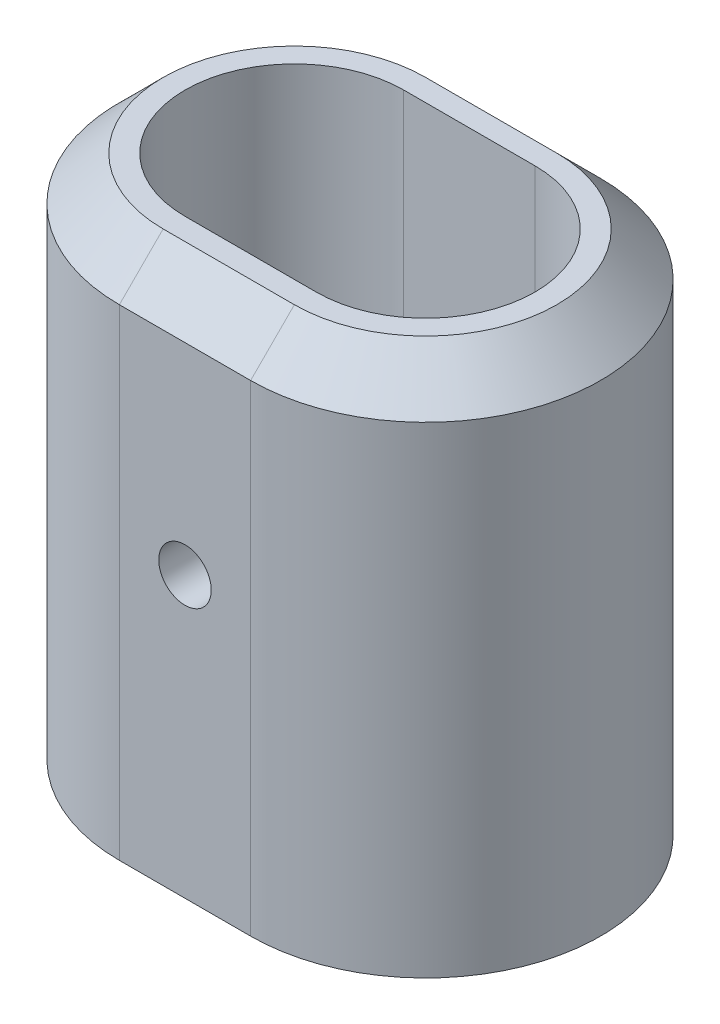
ISO-10303-21;
HEADER;
FILE_DESCRIPTION(('STEP AP214'),'2;1');
FILE_NAME('part.step','',(''),(''),'','','');
FILE_SCHEMA(('AUTOMOTIVE_DESIGN { 1 0 10303 214 1 1 1 1 }'));
ENDSEC;
DATA;
#1=APPLICATION_CONTEXT('core data for automotive mechanical design processes');
#2=APPLICATION_PROTOCOL_DEFINITION('international standard','automotive_design',2000,#1);
#3=PRODUCT_CONTEXT('',#1,'mechanical');
#4=PRODUCT('Part','Part','',(#3));
#5=PRODUCT_RELATED_PRODUCT_CATEGORY('part','',(#4));
#6=PRODUCT_DEFINITION_FORMATION('','',#4);
#7=PRODUCT_DEFINITION_CONTEXT('part definition',#1,'design');
#8=PRODUCT_DEFINITION('design','',#6,#7);
#9=PRODUCT_DEFINITION_SHAPE('','',#8);
#10=(LENGTH_UNIT() NAMED_UNIT(*) SI_UNIT(.MILLI.,.METRE.));
#11=(NAMED_UNIT(*) PLANE_ANGLE_UNIT() SI_UNIT($,.RADIAN.));
#12=(NAMED_UNIT(*) SI_UNIT($,.STERADIAN.) SOLID_ANGLE_UNIT());
#13=UNCERTAINTY_MEASURE_WITH_UNIT(LENGTH_MEASURE(1.E-05),#10,'distance_accuracy_value','');
#14=(GEOMETRIC_REPRESENTATION_CONTEXT(3) GLOBAL_UNCERTAINTY_ASSIGNED_CONTEXT((#13)) GLOBAL_UNIT_ASSIGNED_CONTEXT((#10,
#11,#12)) REPRESENTATION_CONTEXT('',''));
#15=CARTESIAN_POINT('',(0.,0.,0.));
#16=DIRECTION('',(0.,0.,1.));
#17=DIRECTION('',(1.,0.,0.));
#18=AXIS2_PLACEMENT_3D('',#15,#16,#17);
#19=CARTESIAN_POINT('',(0.,60.,0.));
#20=DIRECTION('',(0.,1.,0.));
#21=DIRECTION('',(0.,0.,1.));
#22=AXIS2_PLACEMENT_3D('',#19,#20,#21);
#23=PLANE('',#22);
#24=DIRECTION('',(-1.,0.,0.));
#25=VECTOR('',#24,1.);
#26=CARTESIAN_POINT('',(0.,60.,-15.));
#27=LINE('',#26,#25);
#28=CARTESIAN_POINT('',(15.,60.,-15.));
#29=VERTEX_POINT('',#28);
#30=CARTESIAN_POINT('',(0.,60.,-15.));
#31=VERTEX_POINT('',#30);
#32=EDGE_CURVE('E180',#29,#31,#27,.T.);
#33=ORIENTED_EDGE('',*,*,#32,.T.);
#34=CARTESIAN_POINT('',(0.,60.,0.));
#35=DIRECTION('',(0.,1.,0.));
#36=DIRECTION('',(0.,0.,1.));
#37=AXIS2_PLACEMENT_3D('',#34,#35,#36);
#38=CIRCLE('',#37,15.);
#39=CARTESIAN_POINT('',(0.,60.,15.));
#40=VERTEX_POINT('',#39);
#41=EDGE_CURVE('E184',#31,#40,#38,.T.);
#42=ORIENTED_EDGE('',*,*,#41,.T.);
#43=DIRECTION('',(1.,0.,0.));
#44=VECTOR('',#43,1.);
#45=CARTESIAN_POINT('',(15.,60.,15.));
#46=LINE('',#45,#44);
#47=CARTESIAN_POINT('',(15.,60.,15.));
#48=VERTEX_POINT('',#47);
#49=EDGE_CURVE('E182',#40,#48,#46,.T.);
#50=ORIENTED_EDGE('',*,*,#49,.T.);
#51=CARTESIAN_POINT('',(15.,60.,0.));
#52=DIRECTION('',(0.,1.,0.));
#53=DIRECTION('',(0.,0.,1.));
#54=AXIS2_PLACEMENT_3D('',#51,#52,#53);
#55=CIRCLE('',#54,15.);
#56=EDGE_CURVE('E178',#48,#29,#55,.T.);
#57=ORIENTED_EDGE('',*,*,#56,.T.);
#58=EDGE_LOOP('',(#33,#42,#50,#57));
#59=FACE_BOUND('',#58,.T.);
#60=DIRECTION('',(1.,0.,0.));
#61=VECTOR('',#60,1.);
#62=CARTESIAN_POINT('',(0.,60.,12.5));
#63=LINE('',#62,#61);
#64=CARTESIAN_POINT('',(0.,60.,12.5));
#65=VERTEX_POINT('',#64);
#66=CARTESIAN_POINT('',(15.,60.,12.5));
#67=VERTEX_POINT('',#66);
#68=EDGE_CURVE('E126',#65,#67,#63,.T.);
#69=ORIENTED_EDGE('',*,*,#68,.F.);
#70=CARTESIAN_POINT('',(0.,60.,0.));
#71=DIRECTION('',(0.,1.,0.));
#72=DIRECTION('',(0.,0.,1.));
#73=AXIS2_PLACEMENT_3D('',#70,#71,#72);
#74=CIRCLE('',#73,12.5);
#75=CARTESIAN_POINT('',(0.,60.,-12.5));
#76=VERTEX_POINT('',#75);
#77=EDGE_CURVE('E116',#76,#65,#74,.T.);
#78=ORIENTED_EDGE('',*,*,#77,.F.);
#79=DIRECTION('',(-1.,0.,0.));
#80=VECTOR('',#79,1.);
#81=CARTESIAN_POINT('',(0.,60.,-12.5));
#82=LINE('',#81,#80);
#83=CARTESIAN_POINT('',(15.,60.,-12.5));
#84=VERTEX_POINT('',#83);
#85=EDGE_CURVE('E141',#84,#76,#82,.T.);
#86=ORIENTED_EDGE('',*,*,#85,.F.);
#87=CARTESIAN_POINT('',(15.,60.,0.));
#88=DIRECTION('',(0.,1.,0.));
#89=DIRECTION('',(0.,0.,1.));
#90=AXIS2_PLACEMENT_3D('',#87,#88,#89);
#91=CIRCLE('',#90,12.5);
#92=EDGE_CURVE('E139',#67,#84,#91,.T.);
#93=ORIENTED_EDGE('',*,*,#92,.F.);
#94=EDGE_LOOP('',(#69,#78,#86,#93));
#95=FACE_BOUND('',#94,.T.);
#96=ADVANCED_FACE('F37',(#59,#95),#23,.T.);
#97=CARTESIAN_POINT('',(0.,0.,0.));
#98=DIRECTION('',(0.,1.,0.));
#99=DIRECTION('',(0.,0.,1.));
#100=AXIS2_PLACEMENT_3D('',#97,#98,#99);
#101=PLANE('',#100);
#102=CARTESIAN_POINT('',(0.,0.,0.));
#103=DIRECTION('',(0.,1.,0.));
#104=DIRECTION('',(0.,0.,1.));
#105=AXIS2_PLACEMENT_3D('',#102,#103,#104);
#106=CIRCLE('',#105,20.);
#107=CARTESIAN_POINT('',(0.,0.,-20.));
#108=VERTEX_POINT('',#107);
#109=CARTESIAN_POINT('',(0.,0.,20.));
#110=VERTEX_POINT('',#109);
#111=EDGE_CURVE('E134',#108,#110,#106,.T.);
#112=ORIENTED_EDGE('',*,*,#111,.F.);
#113=DIRECTION('',(-1.,0.,0.));
#114=VECTOR('',#113,1.);
#115=CARTESIAN_POINT('',(0.,0.,-20.));
#116=LINE('',#115,#114);
#117=CARTESIAN_POINT('',(15.,0.,-20.));
#118=VERTEX_POINT('',#117);
#119=EDGE_CURVE('E167',#118,#108,#116,.T.);
#120=ORIENTED_EDGE('',*,*,#119,.F.);
#121=CARTESIAN_POINT('',(15.,0.,0.));
#122=DIRECTION('',(0.,1.,0.));
#123=DIRECTION('',(0.,0.,1.));
#124=AXIS2_PLACEMENT_3D('',#121,#122,#123);
#125=CIRCLE('',#124,20.);
#126=CARTESIAN_POINT('',(15.,0.,20.));
#127=VERTEX_POINT('',#126);
#128=EDGE_CURVE('E164',#127,#118,#125,.T.);
#129=ORIENTED_EDGE('',*,*,#128,.F.);
#130=DIRECTION('',(1.,0.,0.));
#131=VECTOR('',#130,1.);
#132=CARTESIAN_POINT('',(0.,0.,20.));
#133=LINE('',#132,#131);
#134=EDGE_CURVE('E161',#110,#127,#133,.T.);
#135=ORIENTED_EDGE('',*,*,#134,.F.);
#136=EDGE_LOOP('',(#112,#120,#129,#135));
#137=FACE_BOUND('',#136,.T.);
#138=CARTESIAN_POINT('',(0.,0.,0.));
#139=DIRECTION('',(0.,1.,0.));
#140=DIRECTION('',(0.,0.,1.));
#141=AXIS2_PLACEMENT_3D('',#138,#139,#140);
#142=CIRCLE('',#141,12.5);
#143=CARTESIAN_POINT('',(0.,0.,-12.5));
#144=VERTEX_POINT('',#143);
#145=CARTESIAN_POINT('',(0.,0.,12.5));
#146=VERTEX_POINT('',#145);
#147=EDGE_CURVE('E146',#144,#146,#142,.T.);
#148=ORIENTED_EDGE('',*,*,#147,.T.);
#149=DIRECTION('',(1.,0.,0.));
#150=VECTOR('',#149,1.);
#151=CARTESIAN_POINT('',(0.,0.,12.5));
#152=LINE('',#151,#150);
#153=CARTESIAN_POINT('',(15.,0.,12.5));
#154=VERTEX_POINT('',#153);
#155=EDGE_CURVE('E133',#146,#154,#152,.T.);
#156=ORIENTED_EDGE('',*,*,#155,.T.);
#157=CARTESIAN_POINT('',(15.,0.,0.));
#158=DIRECTION('',(0.,1.,0.));
#159=DIRECTION('',(0.,0.,1.));
#160=AXIS2_PLACEMENT_3D('',#157,#158,#159);
#161=CIRCLE('',#160,12.5);
#162=CARTESIAN_POINT('',(15.,0.,-12.5));
#163=VERTEX_POINT('',#162);
#164=EDGE_CURVE('E150',#154,#163,#161,.T.);
#165=ORIENTED_EDGE('',*,*,#164,.T.);
#166=DIRECTION('',(-1.,0.,0.));
#167=VECTOR('',#166,1.);
#168=CARTESIAN_POINT('',(0.,0.,-12.5));
#169=LINE('',#168,#167);
#170=EDGE_CURVE('E127',#163,#144,#169,.T.);
#171=ORIENTED_EDGE('',*,*,#170,.T.);
#172=EDGE_LOOP('',(#148,#156,#165,#171));
#173=FACE_BOUND('',#172,.T.);
#174=ADVANCED_FACE('F227',(#137,#173),#101,.F.);
#175=CARTESIAN_POINT('',(0.,60.,0.));
#176=DIRECTION('',(0.,-1.,0.));
#177=DIRECTION('',(0.,0.,-1.));
#178=AXIS2_PLACEMENT_3D('',#175,#176,#177);
#179=CYLINDRICAL_SURFACE('',#178,20.);
#180=DIRECTION('',(0.,-1.,0.));
#181=VECTOR('',#180,1.);
#182=CARTESIAN_POINT('',(0.,60.,20.));
#183=LINE('',#182,#181);
#184=CARTESIAN_POINT('',(0.,55.,20.));
#185=VERTEX_POINT('',#184);
#186=EDGE_CURVE('E176',#185,#110,#183,.T.);
#187=ORIENTED_EDGE('',*,*,#186,.F.);
#188=CARTESIAN_POINT('',(0.,55.,0.));
#189=DIRECTION('',(0.,1.,0.));
#190=DIRECTION('',(0.,0.,1.));
#191=AXIS2_PLACEMENT_3D('',#188,#189,#190);
#192=CIRCLE('',#191,20.);
#193=CARTESIAN_POINT('',(0.,55.,-20.));
#194=VERTEX_POINT('',#193);
#195=EDGE_CURVE('E187',#185,#194,#192,.F.);
#196=ORIENTED_EDGE('',*,*,#195,.T.);
#197=DIRECTION('',(0.,-1.,0.));
#198=VECTOR('',#197,1.);
#199=CARTESIAN_POINT('',(0.,60.,-20.));
#200=LINE('',#199,#198);
#201=EDGE_CURVE('E170',#194,#108,#200,.T.);
#202=ORIENTED_EDGE('',*,*,#201,.T.);
#203=ORIENTED_EDGE('',*,*,#111,.T.);
#204=EDGE_LOOP('',(#187,#196,#202,#203));
#205=FACE_BOUND('',#204,.T.);
#206=ADVANCED_FACE('F220',(#205),#179,.T.);
#207=CARTESIAN_POINT('',(0.,60.,20.));
#208=DIRECTION('',(0.,0.,-1.));
#209=DIRECTION('',(-1.,0.,0.));
#210=AXIS2_PLACEMENT_3D('',#207,#208,#209);
#211=PLANE('',#210);
#212=CARTESIAN_POINT('',(7.5,32.,20.));
#213=DIRECTION('',(0.,0.,1.));
#214=DIRECTION('',(1.,0.,0.));
#215=AXIS2_PLACEMENT_3D('',#212,#213,#214);
#216=CIRCLE('',#215,3.);
#217=CARTESIAN_POINT('',(10.5,32.,20.));
#218=VERTEX_POINT('',#217);
#219=EDGE_CURVE('E294',#218,#218,#216,.T.);
#220=ORIENTED_EDGE('',*,*,#219,.F.);
#221=EDGE_LOOP('',(#220));
#222=FACE_BOUND('',#221,.T.);
#223=DIRECTION('',(0.,-1.,0.));
#224=VECTOR('',#223,1.);
#225=CARTESIAN_POINT('',(15.,60.,20.));
#226=LINE('',#225,#224);
#227=CARTESIAN_POINT('',(15.,55.,20.));
#228=VERTEX_POINT('',#227);
#229=EDGE_CURVE('E174',#228,#127,#226,.T.);
#230=ORIENTED_EDGE('',*,*,#229,.F.);
#231=DIRECTION('',(-1.,0.,0.));
#232=VECTOR('',#231,1.);
#233=CARTESIAN_POINT('',(0.,55.,20.));
#234=LINE('',#233,#232);
#235=EDGE_CURVE('E190',#228,#185,#234,.T.);
#236=ORIENTED_EDGE('',*,*,#235,.T.);
#237=ORIENTED_EDGE('',*,*,#186,.T.);
#238=ORIENTED_EDGE('',*,*,#134,.T.);
#239=EDGE_LOOP('',(#230,#236,#237,#238));
#240=FACE_BOUND('',#239,.T.);
#241=ADVANCED_FACE('F216',(#222,#240),#211,.F.);
#242=CARTESIAN_POINT('',(15.,60.,0.));
#243=DIRECTION('',(0.,-1.,0.));
#244=DIRECTION('',(0.,0.,-1.));
#245=AXIS2_PLACEMENT_3D('',#242,#243,#244);
#246=CYLINDRICAL_SURFACE('',#245,20.);
#247=DIRECTION('',(0.,-1.,0.));
#248=VECTOR('',#247,1.);
#249=CARTESIAN_POINT('',(15.,60.,-20.));
#250=LINE('',#249,#248);
#251=CARTESIAN_POINT('',(15.,55.,-20.));
#252=VERTEX_POINT('',#251);
#253=EDGE_CURVE('E172',#252,#118,#250,.T.);
#254=ORIENTED_EDGE('',*,*,#253,.F.);
#255=CARTESIAN_POINT('',(15.,55.,0.));
#256=DIRECTION('',(0.,1.,0.));
#257=DIRECTION('',(0.,0.,1.));
#258=AXIS2_PLACEMENT_3D('',#255,#256,#257);
#259=CIRCLE('',#258,20.);
#260=EDGE_CURVE('E11',#252,#228,#259,.F.);
#261=ORIENTED_EDGE('',*,*,#260,.T.);
#262=ORIENTED_EDGE('',*,*,#229,.T.);
#263=ORIENTED_EDGE('',*,*,#128,.T.);
#264=EDGE_LOOP('',(#254,#261,#262,#263));
#265=FACE_BOUND('',#264,.T.);
#266=ADVANCED_FACE('F240',(#265),#246,.T.);
#267=CARTESIAN_POINT('',(0.,60.,-20.));
#268=DIRECTION('',(0.,0.,1.));
#269=DIRECTION('',(1.,0.,0.));
#270=AXIS2_PLACEMENT_3D('',#267,#268,#269);
#271=PLANE('',#270);
#272=CARTESIAN_POINT('',(7.5,32.,-20.));
#273=DIRECTION('',(0.,0.,1.));
#274=DIRECTION('',(1.,0.,0.));
#275=AXIS2_PLACEMENT_3D('',#272,#273,#274);
#276=CIRCLE('',#275,3.);
#277=CARTESIAN_POINT('',(10.5,32.,-20.));
#278=VERTEX_POINT('',#277);
#279=EDGE_CURVE('E290',#278,#278,#276,.F.);
#280=ORIENTED_EDGE('',*,*,#279,.F.);
#281=EDGE_LOOP('',(#280));
#282=FACE_BOUND('',#281,.T.);
#283=ORIENTED_EDGE('',*,*,#201,.F.);
#284=DIRECTION('',(1.,0.,0.));
#285=VECTOR('',#284,1.);
#286=CARTESIAN_POINT('',(15.,55.,-20.));
#287=LINE('',#286,#285);
#288=EDGE_CURVE('E47',#194,#252,#287,.T.);
#289=ORIENTED_EDGE('',*,*,#288,.T.);
#290=ORIENTED_EDGE('',*,*,#253,.T.);
#291=ORIENTED_EDGE('',*,*,#119,.T.);
#292=EDGE_LOOP('',(#283,#289,#290,#291));
#293=FACE_BOUND('',#292,.T.);
#294=ADVANCED_FACE('F237',(#282,#293),#271,.F.);
#295=CARTESIAN_POINT('',(0.,60.,0.));
#296=DIRECTION('',(0.,-1.,0.));
#297=DIRECTION('',(0.,0.,-1.));
#298=AXIS2_PLACEMENT_3D('',#295,#296,#297);
#299=CYLINDRICAL_SURFACE('',#298,12.5);
#300=ORIENTED_EDGE('',*,*,#147,.F.);
#301=DIRECTION('',(0.,-1.,0.));
#302=VECTOR('',#301,1.);
#303=CARTESIAN_POINT('',(0.,60.,-12.5));
#304=LINE('',#303,#302);
#305=EDGE_CURVE('E122',#76,#144,#304,.T.);
#306=ORIENTED_EDGE('',*,*,#305,.F.);
#307=ORIENTED_EDGE('',*,*,#77,.T.);
#308=DIRECTION('',(0.,-1.,0.));
#309=VECTOR('',#308,1.);
#310=CARTESIAN_POINT('',(0.,60.,12.5));
#311=LINE('',#310,#309);
#312=EDGE_CURVE('E119',#65,#146,#311,.T.);
#313=ORIENTED_EDGE('',*,*,#312,.T.);
#314=EDGE_LOOP('',(#300,#306,#307,#313));
#315=FACE_BOUND('',#314,.T.);
#316=ADVANCED_FACE('F118',(#315),#299,.F.);
#317=CARTESIAN_POINT('',(0.,60.,12.5));
#318=DIRECTION('',(0.,0.,-1.));
#319=DIRECTION('',(-1.,0.,0.));
#320=AXIS2_PLACEMENT_3D('',#317,#318,#319);
#321=PLANE('',#320);
#322=CARTESIAN_POINT('',(7.5,32.,12.5));
#323=DIRECTION('',(0.,0.,-1.));
#324=DIRECTION('',(-1.,0.,0.));
#325=AXIS2_PLACEMENT_3D('',#322,#323,#324);
#326=CIRCLE('',#325,3.);
#327=CARTESIAN_POINT('',(4.5,32.,12.5));
#328=VERTEX_POINT('',#327);
#329=EDGE_CURVE('E196',#328,#328,#326,.T.);
#330=ORIENTED_EDGE('',*,*,#329,.F.);
#331=EDGE_LOOP('',(#330));
#332=FACE_BOUND('',#331,.T.);
#333=ORIENTED_EDGE('',*,*,#155,.F.);
#334=ORIENTED_EDGE('',*,*,#312,.F.);
#335=ORIENTED_EDGE('',*,*,#68,.T.);
#336=DIRECTION('',(0.,-1.,0.));
#337=VECTOR('',#336,1.);
#338=CARTESIAN_POINT('',(15.,60.,12.5));
#339=LINE('',#338,#337);
#340=EDGE_CURVE('E135',#67,#154,#339,.T.);
#341=ORIENTED_EDGE('',*,*,#340,.T.);
#342=EDGE_LOOP('',(#333,#334,#335,#341));
#343=FACE_BOUND('',#342,.T.);
#344=ADVANCED_FACE('F130',(#332,#343),#321,.T.);
#345=CARTESIAN_POINT('',(15.,60.,0.));
#346=DIRECTION('',(0.,-1.,0.));
#347=DIRECTION('',(0.,0.,-1.));
#348=AXIS2_PLACEMENT_3D('',#345,#346,#347);
#349=CYLINDRICAL_SURFACE('',#348,12.5);
#350=ORIENTED_EDGE('',*,*,#164,.F.);
#351=ORIENTED_EDGE('',*,*,#340,.F.);
#352=ORIENTED_EDGE('',*,*,#92,.T.);
#353=DIRECTION('',(0.,-1.,0.));
#354=VECTOR('',#353,1.);
#355=CARTESIAN_POINT('',(15.,60.,-12.5));
#356=LINE('',#355,#354);
#357=EDGE_CURVE('E156',#84,#163,#356,.T.);
#358=ORIENTED_EDGE('',*,*,#357,.T.);
#359=EDGE_LOOP('',(#350,#351,#352,#358));
#360=FACE_BOUND('',#359,.T.);
#361=ADVANCED_FACE('F270',(#360),#349,.F.);
#362=CARTESIAN_POINT('',(0.,60.,-12.5));
#363=DIRECTION('',(0.,0.,1.));
#364=DIRECTION('',(1.,0.,0.));
#365=AXIS2_PLACEMENT_3D('',#362,#363,#364);
#366=PLANE('',#365);
#367=CARTESIAN_POINT('',(7.5,32.,-12.5));
#368=DIRECTION('',(0.,0.,1.));
#369=DIRECTION('',(1.,0.,0.));
#370=AXIS2_PLACEMENT_3D('',#367,#368,#369);
#371=CIRCLE('',#370,3.);
#372=CARTESIAN_POINT('',(10.5,32.,-12.5));
#373=VERTEX_POINT('',#372);
#374=EDGE_CURVE('E42',#373,#373,#371,.T.);
#375=ORIENTED_EDGE('',*,*,#374,.F.);
#376=EDGE_LOOP('',(#375));
#377=FACE_BOUND('',#376,.T.);
#378=ORIENTED_EDGE('',*,*,#170,.F.);
#379=ORIENTED_EDGE('',*,*,#357,.F.);
#380=ORIENTED_EDGE('',*,*,#85,.T.);
#381=ORIENTED_EDGE('',*,*,#305,.T.);
#382=EDGE_LOOP('',(#378,#379,#380,#381));
#383=FACE_BOUND('',#382,.T.);
#384=ADVANCED_FACE('F266',(#377,#383),#366,.T.);
#385=CARTESIAN_POINT('',(15.,60.,0.));
#386=DIRECTION('',(0.,-1.,0.));
#387=DIRECTION('',(0.,0.,-1.));
#388=AXIS2_PLACEMENT_3D('',#385,#386,#387);
#389=CONICAL_SURFACE('',#388,15.,0.785398163397448);
#390=DIRECTION('',(0.,0.707106781186548,-0.707106781186547));
#391=VECTOR('',#390,1.);
#392=CARTESIAN_POINT('',(15.,55.,20.));
#393=LINE('',#392,#391);
#394=EDGE_CURVE('E198',#228,#48,#393,.T.);
#395=ORIENTED_EDGE('',*,*,#394,.F.);
#396=ORIENTED_EDGE('',*,*,#260,.F.);
#397=DIRECTION('',(0.,-0.707106781186548,-0.707106781186547));
#398=VECTOR('',#397,1.);
#399=CARTESIAN_POINT('',(15.,60.,-15.));
#400=LINE('',#399,#398);
#401=EDGE_CURVE('E148',#29,#252,#400,.T.);
#402=ORIENTED_EDGE('',*,*,#401,.F.);
#403=ORIENTED_EDGE('',*,*,#56,.F.);
#404=EDGE_LOOP('',(#395,#396,#402,#403));
#405=FACE_BOUND('',#404,.T.);
#406=ADVANCED_FACE('F40',(#405),#389,.T.);
#407=CARTESIAN_POINT('',(0.,60.,-15.));
#408=DIRECTION('',(0.,0.707106781186547,-0.707106781186548));
#409=DIRECTION('',(1.,0.,0.));
#410=AXIS2_PLACEMENT_3D('',#407,#408,#409);
#411=PLANE('',#410);
#412=ORIENTED_EDGE('',*,*,#401,.T.);
#413=ORIENTED_EDGE('',*,*,#288,.F.);
#414=DIRECTION('',(0.,-0.707106781186548,-0.707106781186547));
#415=VECTOR('',#414,1.);
#416=CARTESIAN_POINT('',(0.,60.,-15.));
#417=LINE('',#416,#415);
#418=EDGE_CURVE('E195',#31,#194,#417,.T.);
#419=ORIENTED_EDGE('',*,*,#418,.F.);
#420=ORIENTED_EDGE('',*,*,#32,.F.);
#421=EDGE_LOOP('',(#412,#413,#419,#420));
#422=FACE_BOUND('',#421,.T.);
#423=ADVANCED_FACE('F204',(#422),#411,.T.);
#424=CARTESIAN_POINT('',(0.,60.,15.));
#425=DIRECTION('',(0.,0.707106781186547,0.707106781186548));
#426=DIRECTION('',(-1.,0.,0.));
#427=AXIS2_PLACEMENT_3D('',#424,#425,#426);
#428=PLANE('',#427);
#429=ORIENTED_EDGE('',*,*,#394,.T.);
#430=ORIENTED_EDGE('',*,*,#49,.F.);
#431=DIRECTION('',(0.,0.707106781186548,-0.707106781186547));
#432=VECTOR('',#431,1.);
#433=CARTESIAN_POINT('',(0.,55.,20.));
#434=LINE('',#433,#432);
#435=EDGE_CURVE('E193',#185,#40,#434,.T.);
#436=ORIENTED_EDGE('',*,*,#435,.F.);
#437=ORIENTED_EDGE('',*,*,#235,.F.);
#438=EDGE_LOOP('',(#429,#430,#436,#437));
#439=FACE_BOUND('',#438,.T.);
#440=ADVANCED_FACE('F213',(#439),#428,.T.);
#441=CARTESIAN_POINT('',(0.,60.,0.));
#442=DIRECTION('',(0.,-1.,0.));
#443=DIRECTION('',(0.,0.,-1.));
#444=AXIS2_PLACEMENT_3D('',#441,#442,#443);
#445=CONICAL_SURFACE('',#444,15.,0.785398163397448);
#446=ORIENTED_EDGE('',*,*,#418,.T.);
#447=ORIENTED_EDGE('',*,*,#195,.F.);
#448=ORIENTED_EDGE('',*,*,#435,.T.);
#449=ORIENTED_EDGE('',*,*,#41,.F.);
#450=EDGE_LOOP('',(#446,#447,#448,#449));
#451=FACE_BOUND('',#450,.T.);
#452=ADVANCED_FACE('F223',(#451),#445,.T.);
#453=CARTESIAN_POINT('',(7.5,32.,-28.4852813742386));
#454=DIRECTION('',(0.,0.,1.));
#455=DIRECTION('',(1.,0.,0.));
#456=AXIS2_PLACEMENT_3D('',#453,#454,#455);
#457=CYLINDRICAL_SURFACE('',#456,3.);
#458=ORIENTED_EDGE('',*,*,#374,.T.);
#459=EDGE_LOOP('',(#458));
#460=FACE_BOUND('',#459,.T.);
#461=ORIENTED_EDGE('',*,*,#279,.T.);
#462=EDGE_LOOP('',(#461));
#463=FACE_BOUND('',#462,.T.);
#464=ADVANCED_FACE('F255',(#460,#463),#457,.F.);
#465=ORIENTED_EDGE('',*,*,#329,.T.);
#466=EDGE_LOOP('',(#465));
#467=FACE_BOUND('',#466,.T.);
#468=ORIENTED_EDGE('',*,*,#219,.T.);
#469=EDGE_LOOP('',(#468));
#470=FACE_BOUND('',#469,.T.);
#471=ADVANCED_FACE('F298',(#467,#470),#457,.F.);
#472=CLOSED_SHELL('',(#96,#174,#206,#241,#266,#294,#316,#344,#361,#384,#406,#423,#440,#452,#464,#471));
#473=MANIFOLD_SOLID_BREP('B2',#472);
#474=ADVANCED_BREP_SHAPE_REPRESENTATION('',(#18,#473),#14);
#475=SHAPE_DEFINITION_REPRESENTATION(#9,#474);
ENDSEC;
END-ISO-10303-21;
